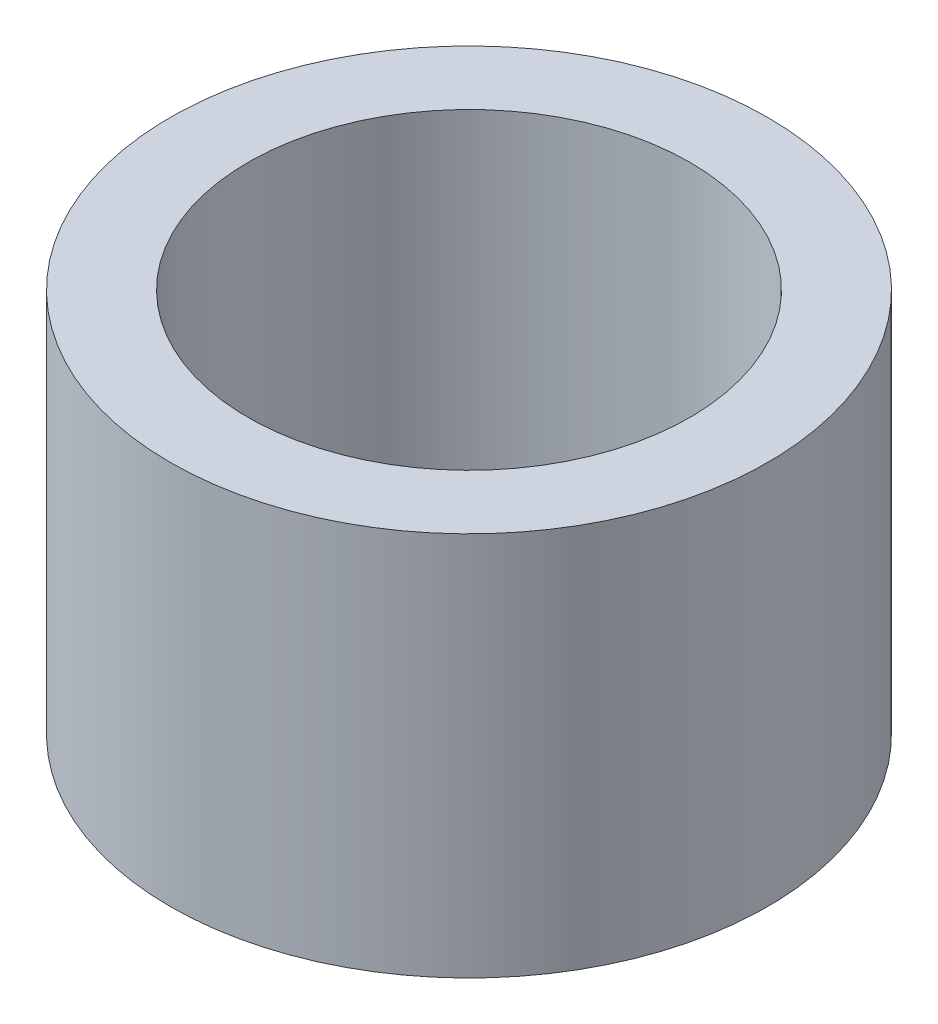
ISO-10303-21;
HEADER;
FILE_DESCRIPTION(('STEP AP214'),'2;1');
FILE_NAME('part.step','',(''),(''),'','','');
FILE_SCHEMA(('AUTOMOTIVE_DESIGN { 1 0 10303 214 1 1 1 1 }'));
ENDSEC;
DATA;
#1=APPLICATION_CONTEXT('core data for automotive mechanical design processes');
#2=APPLICATION_PROTOCOL_DEFINITION('international standard','automotive_design',2000,#1);
#3=PRODUCT_CONTEXT('',#1,'mechanical');
#4=PRODUCT('Part','Part','',(#3));
#5=PRODUCT_RELATED_PRODUCT_CATEGORY('part','',(#4));
#6=PRODUCT_DEFINITION_FORMATION('','',#4);
#7=PRODUCT_DEFINITION_CONTEXT('part definition',#1,'design');
#8=PRODUCT_DEFINITION('design','',#6,#7);
#9=PRODUCT_DEFINITION_SHAPE('','',#8);
#10=(LENGTH_UNIT() NAMED_UNIT(*) SI_UNIT(.MILLI.,.METRE.));
#11=(NAMED_UNIT(*) PLANE_ANGLE_UNIT() SI_UNIT($,.RADIAN.));
#12=(NAMED_UNIT(*) SI_UNIT($,.STERADIAN.) SOLID_ANGLE_UNIT());
#13=UNCERTAINTY_MEASURE_WITH_UNIT(LENGTH_MEASURE(1.E-05),#10,'distance_accuracy_value','');
#14=(GEOMETRIC_REPRESENTATION_CONTEXT(3) GLOBAL_UNCERTAINTY_ASSIGNED_CONTEXT((#13)) GLOBAL_UNIT_ASSIGNED_CONTEXT((#10,
#11,#12)) REPRESENTATION_CONTEXT('',''));
#15=CARTESIAN_POINT('',(0.,0.,0.));
#16=DIRECTION('',(0.,0.,1.));
#17=DIRECTION('',(1.,0.,0.));
#18=AXIS2_PLACEMENT_3D('',#15,#16,#17);
#19=CARTESIAN_POINT('',(0.,28.9701515864055,0.));
#20=DIRECTION('',(0.,-1.,0.));
#21=DIRECTION('',(0.,0.,-1.));
#22=AXIS2_PLACEMENT_3D('',#19,#20,#21);
#23=CYLINDRICAL_SURFACE('',#22,22.5);
#24=CARTESIAN_POINT('',(0.,28.9701515864055,0.));
#25=DIRECTION('',(0.,1.,0.));
#26=DIRECTION('',(0.,0.,1.));
#27=AXIS2_PLACEMENT_3D('',#24,#25,#26);
#28=CIRCLE('',#27,22.5);
#29=CARTESIAN_POINT('',(0.,28.9701515864055,-22.5));
#30=VERTEX_POINT('',#29);
#31=EDGE_CURVE('E10',#30,#30,#28,.T.);
#32=CARTESIAN_POINT('',(0.,0.,0.));
#33=DIRECTION('',(0.,1.,0.));
#34=DIRECTION('',(0.,0.,1.));
#35=AXIS2_PLACEMENT_3D('',#32,#33,#34);
#36=CIRCLE('',#35,22.5);
#37=CARTESIAN_POINT('',(0.,0.,-22.5));
#38=VERTEX_POINT('',#37);
#39=EDGE_CURVE('E37',#38,#38,#36,.T.);
#40=CARTESIAN_POINT('',(0.,28.9701515864055,-22.5));
#41=CARTESIAN_POINT('',(0.,28.6683791740471,-22.5));
#42=CARTESIAN_POINT('',(0.,28.3666067616887,-22.5));
#43=CARTESIAN_POINT('',(0.,27.763061936972,-22.5));
#44=CARTESIAN_POINT('',(0.,27.4612895246136,-22.5));
#45=CARTESIAN_POINT('',(0.,26.8577446998968,-22.5));
#46=CARTESIAN_POINT('',(0.,26.5559722875384,-22.5));
#47=CARTESIAN_POINT('',(0.,25.9524274628216,-22.5));
#48=CARTESIAN_POINT('',(0.,25.6506550504632,-22.5));
#49=CARTESIAN_POINT('',(0.,25.0471102257464,-22.5));
#50=CARTESIAN_POINT('',(0.,24.745337813388,-22.5));
#51=CARTESIAN_POINT('',(0.,24.1417929886713,-22.5));
#52=CARTESIAN_POINT('',(0.,23.8400205763129,-22.5));
#53=CARTESIAN_POINT('',(0.,23.2364757515961,-22.5));
#54=CARTESIAN_POINT('',(0.,22.9347033392377,-22.5));
#55=CARTESIAN_POINT('',(0.,22.3311585145209,-22.5));
#56=CARTESIAN_POINT('',(0.,22.0293861021625,-22.5));
#57=CARTESIAN_POINT('',(0.,21.4258412774457,-22.5));
#58=CARTESIAN_POINT('',(0.,21.1240688650874,-22.5));
#59=CARTESIAN_POINT('',(0.,20.5205240403706,-22.5));
#60=CARTESIAN_POINT('',(0.,20.2187516280122,-22.5));
#61=CARTESIAN_POINT('',(0.,19.6152068032954,-22.5));
#62=CARTESIAN_POINT('',(0.,19.313434390937,-22.5));
#63=CARTESIAN_POINT('',(0.,18.7098895662202,-22.5));
#64=CARTESIAN_POINT('',(0.,18.4081171538618,-22.5));
#65=CARTESIAN_POINT('',(0.,17.8045723291451,-22.5));
#66=CARTESIAN_POINT('',(0.,17.5027999167867,-22.5));
#67=CARTESIAN_POINT('',(0.,16.8992550920699,-22.5));
#68=CARTESIAN_POINT('',(0.,16.5974826797115,-22.5));
#69=CARTESIAN_POINT('',(0.,15.9939378549947,-22.5));
#70=CARTESIAN_POINT('',(0.,15.6921654426363,-22.5));
#71=CARTESIAN_POINT('',(0.,15.0886206179195,-22.5));
#72=CARTESIAN_POINT('',(0.,14.7868482055611,-22.5));
#73=CARTESIAN_POINT('',(0.,14.1833033808444,-22.5));
#74=CARTESIAN_POINT('',(0.,13.881530968486,-22.5));
#75=CARTESIAN_POINT('',(0.,13.2779861437692,-22.5));
#76=CARTESIAN_POINT('',(0.,12.9762137314108,-22.5));
#77=CARTESIAN_POINT('',(0.,12.372668906694,-22.5));
#78=CARTESIAN_POINT('',(0.,12.0708964943356,-22.5));
#79=CARTESIAN_POINT('',(0.,11.4673516696188,-22.5));
#80=CARTESIAN_POINT('',(0.,11.1655792572605,-22.5));
#81=CARTESIAN_POINT('',(0.,10.5620344325437,-22.5));
#82=CARTESIAN_POINT('',(0.,10.2602620201853,-22.5));
#83=CARTESIAN_POINT('',(0.,9.65671719546851,-22.5));
#84=CARTESIAN_POINT('',(0.,9.35494478311011,-22.5));
#85=CARTESIAN_POINT('',(0.,8.75139995839333,-22.5));
#86=CARTESIAN_POINT('',(0.,8.44962754603494,-22.5));
#87=CARTESIAN_POINT('',(0.,7.84608272131816,-22.5));
#88=CARTESIAN_POINT('',(0.,7.54431030895977,-22.5));
#89=CARTESIAN_POINT('',(0.,6.94076548424299,-22.5));
#90=CARTESIAN_POINT('',(0.,6.6389930718846,-22.5));
#91=CARTESIAN_POINT('',(0.,6.03544824716782,-22.5));
#92=CARTESIAN_POINT('',(0.,5.73367583480942,-22.5));
#93=CARTESIAN_POINT('',(0.,5.13013101009264,-22.5));
#94=CARTESIAN_POINT('',(0.,4.82835859773425,-22.5));
#95=CARTESIAN_POINT('',(0.,4.22481377301747,-22.5));
#96=CARTESIAN_POINT('',(0.,3.92304136065908,-22.5));
#97=CARTESIAN_POINT('',(0.,3.3194965359423,-22.5));
#98=CARTESIAN_POINT('',(0.,3.01772412358391,-22.5));
#99=CARTESIAN_POINT('',(0.,2.41417929886713,-22.5));
#100=CARTESIAN_POINT('',(0.,2.11240688650874,-22.5));
#101=CARTESIAN_POINT('',(0.,1.50886206179195,-22.5));
#102=CARTESIAN_POINT('',(0.,1.20708964943356,-22.5));
#103=CARTESIAN_POINT('',(0.,0.603544824716781,-22.5));
#104=CARTESIAN_POINT('',(0.,0.30177241235839,-22.5));
#105=CARTESIAN_POINT('',(0.,0.,-22.5));
#106=B_SPLINE_CURVE_WITH_KNOTS('',3,(#40,#41,#42,#43,#44,#45,#46,#47,#48,#49,#50,#51,#52,#53,
#54,#55,#56,#57,#58,#59,#60,#61,#62,#63,#64,#65,#66,#67,#68,#69,#70,#71,#72,#73,#74,#75,#76,#77,
#78,#79,#80,#81,#82,#83,#84,#85,#86,#87,#88,#89,#90,#91,#92,#93,#94,#95,#96,#97,#98,#99,#100,
#101,#102,#103,#104,#105),.UNSPECIFIED.,.F.,.F.,(4,2,2,2,2,2,2,2,2,2,2,2,2,2,2,2,2,2,2,2,2,2,2,
2,2,2,2,2,2,2,2,2,4),(0.,0.905317237075171,1.81063447415034,2.71595171122551,3.62126894830069,
4.52658618537586,5.43190342245103,6.33722065952621,7.24253789660138,8.14785513367655,
9.05317237075172,9.95848960782689,10.8638068449021,11.7691240819772,12.6744413190524,
13.5797585561276,14.4850757932028,15.3903930302779,16.2957102673531,17.2010275044283,
18.1063447415034,19.0116619785786,19.9169792156538,20.822296452729,21.7276136898041,
22.6329309268793,23.5382481639545,24.4435654010297,25.3488826381048,26.25419987518,
27.1595171122552,28.0648343493303,28.9701515864055),.UNSPECIFIED.);
#107=EDGE_CURVE('BSEAM40',#30,#38,#106,.T.);
#108=ORIENTED_EDGE('',*,*,#31,.F.);
#109=ORIENTED_EDGE('',*,*,#39,.T.);
#110=ORIENTED_EDGE('',*,*,#107,.T.);
#111=ORIENTED_EDGE('',*,*,#107,.F.);
#112=EDGE_LOOP('',(#108,#110,#109,#111));
#113=FACE_BOUND('',#112,.T.);
#114=ADVANCED_FACE('F40',(#113),#23,.T.);
#115=CARTESIAN_POINT('',(0.,28.9701515864055,0.));
#116=DIRECTION('',(0.,1.,0.));
#117=DIRECTION('',(0.,0.,1.));
#118=AXIS2_PLACEMENT_3D('',#115,#116,#117);
#119=PLANE('',#118);
#120=CARTESIAN_POINT('',(0.,28.9701515864055,0.));
#121=DIRECTION('',(0.,1.,0.));
#122=DIRECTION('',(0.,0.,1.));
#123=AXIS2_PLACEMENT_3D('',#120,#121,#122);
#124=CIRCLE('',#123,16.6405609110903);
#125=CARTESIAN_POINT('',(0.,28.9701515864055,-16.6405609110903));
#126=VERTEX_POINT('',#125);
#127=EDGE_CURVE('E50',#126,#126,#124,.T.);
#128=ORIENTED_EDGE('',*,*,#127,.F.);
#129=EDGE_LOOP('',(#128));
#130=FACE_BOUND('',#129,.T.);
#131=ORIENTED_EDGE('',*,*,#31,.T.);
#132=EDGE_LOOP('',(#131));
#133=FACE_BOUND('',#132,.T.);
#134=ADVANCED_FACE('F59',(#130,#133),#119,.T.);
#135=CARTESIAN_POINT('',(0.,0.,0.));
#136=DIRECTION('',(0.,1.,0.));
#137=DIRECTION('',(0.,0.,1.));
#138=AXIS2_PLACEMENT_3D('',#135,#136,#137);
#139=PLANE('',#138);
#140=CARTESIAN_POINT('',(0.,0.,0.));
#141=DIRECTION('',(0.,1.,0.));
#142=DIRECTION('',(0.,0.,1.));
#143=AXIS2_PLACEMENT_3D('',#140,#141,#142);
#144=CIRCLE('',#143,16.6405609110903);
#145=CARTESIAN_POINT('',(0.,0.,-16.6405609110903));
#146=VERTEX_POINT('',#145);
#147=EDGE_CURVE('E47',#146,#146,#144,.T.);
#148=ORIENTED_EDGE('',*,*,#147,.T.);
#149=EDGE_LOOP('',(#148));
#150=FACE_BOUND('',#149,.T.);
#151=ORIENTED_EDGE('',*,*,#39,.F.);
#152=EDGE_LOOP('',(#151));
#153=FACE_BOUND('',#152,.T.);
#154=ADVANCED_FACE('F58',(#150,#153),#139,.F.);
#155=CARTESIAN_POINT('',(0.,28.9701515864055,0.));
#156=DIRECTION('',(0.,-1.,0.));
#157=DIRECTION('',(0.,0.,-1.));
#158=AXIS2_PLACEMENT_3D('',#155,#156,#157);
#159=CYLINDRICAL_SURFACE('',#158,16.6405609110903);
#160=CARTESIAN_POINT('',(0.,28.9701515864055,-16.6405609110903));
#161=CARTESIAN_POINT('',(0.,28.6683791740471,-16.6405609110903));
#162=CARTESIAN_POINT('',(0.,28.3666067616887,-16.6405609110903));
#163=CARTESIAN_POINT('',(0.,27.763061936972,-16.6405609110903));
#164=CARTESIAN_POINT('',(0.,27.4612895246136,-16.6405609110903));
#165=CARTESIAN_POINT('',(0.,26.8577446998968,-16.6405609110903));
#166=CARTESIAN_POINT('',(0.,26.5559722875384,-16.6405609110903));
#167=CARTESIAN_POINT('',(0.,25.9524274628216,-16.6405609110903));
#168=CARTESIAN_POINT('',(0.,25.6506550504632,-16.6405609110903));
#169=CARTESIAN_POINT('',(0.,25.0471102257464,-16.6405609110903));
#170=CARTESIAN_POINT('',(0.,24.745337813388,-16.6405609110903));
#171=CARTESIAN_POINT('',(0.,24.1417929886713,-16.6405609110903));
#172=CARTESIAN_POINT('',(0.,23.8400205763129,-16.6405609110903));
#173=CARTESIAN_POINT('',(0.,23.2364757515961,-16.6405609110903));
#174=CARTESIAN_POINT('',(0.,22.9347033392377,-16.6405609110903));
#175=CARTESIAN_POINT('',(0.,22.3311585145209,-16.6405609110903));
#176=CARTESIAN_POINT('',(0.,22.0293861021625,-16.6405609110903));
#177=CARTESIAN_POINT('',(0.,21.4258412774457,-16.6405609110903));
#178=CARTESIAN_POINT('',(0.,21.1240688650874,-16.6405609110903));
#179=CARTESIAN_POINT('',(0.,20.5205240403706,-16.6405609110903));
#180=CARTESIAN_POINT('',(0.,20.2187516280122,-16.6405609110903));
#181=CARTESIAN_POINT('',(0.,19.6152068032954,-16.6405609110903));
#182=CARTESIAN_POINT('',(0.,19.313434390937,-16.6405609110903));
#183=CARTESIAN_POINT('',(0.,18.7098895662202,-16.6405609110903));
#184=CARTESIAN_POINT('',(0.,18.4081171538618,-16.6405609110903));
#185=CARTESIAN_POINT('',(0.,17.8045723291451,-16.6405609110903));
#186=CARTESIAN_POINT('',(0.,17.5027999167867,-16.6405609110903));
#187=CARTESIAN_POINT('',(0.,16.8992550920699,-16.6405609110903));
#188=CARTESIAN_POINT('',(0.,16.5974826797115,-16.6405609110903));
#189=CARTESIAN_POINT('',(0.,15.9939378549947,-16.6405609110903));
#190=CARTESIAN_POINT('',(0.,15.6921654426363,-16.6405609110903));
#191=CARTESIAN_POINT('',(0.,15.0886206179195,-16.6405609110903));
#192=CARTESIAN_POINT('',(0.,14.7868482055611,-16.6405609110903));
#193=CARTESIAN_POINT('',(0.,14.1833033808444,-16.6405609110903));
#194=CARTESIAN_POINT('',(0.,13.881530968486,-16.6405609110903));
#195=CARTESIAN_POINT('',(0.,13.2779861437692,-16.6405609110903));
#196=CARTESIAN_POINT('',(0.,12.9762137314108,-16.6405609110903));
#197=CARTESIAN_POINT('',(0.,12.372668906694,-16.6405609110903));
#198=CARTESIAN_POINT('',(0.,12.0708964943356,-16.6405609110903));
#199=CARTESIAN_POINT('',(0.,11.4673516696188,-16.6405609110903));
#200=CARTESIAN_POINT('',(0.,11.1655792572605,-16.6405609110903));
#201=CARTESIAN_POINT('',(0.,10.5620344325437,-16.6405609110903));
#202=CARTESIAN_POINT('',(0.,10.2602620201853,-16.6405609110903));
#203=CARTESIAN_POINT('',(0.,9.65671719546851,-16.6405609110903));
#204=CARTESIAN_POINT('',(0.,9.35494478311011,-16.6405609110903));
#205=CARTESIAN_POINT('',(0.,8.75139995839333,-16.6405609110903));
#206=CARTESIAN_POINT('',(0.,8.44962754603494,-16.6405609110903));
#207=CARTESIAN_POINT('',(0.,7.84608272131816,-16.6405609110903));
#208=CARTESIAN_POINT('',(0.,7.54431030895977,-16.6405609110903));
#209=CARTESIAN_POINT('',(0.,6.94076548424299,-16.6405609110903));
#210=CARTESIAN_POINT('',(0.,6.6389930718846,-16.6405609110903));
#211=CARTESIAN_POINT('',(0.,6.03544824716782,-16.6405609110903));
#212=CARTESIAN_POINT('',(0.,5.73367583480942,-16.6405609110903));
#213=CARTESIAN_POINT('',(0.,5.13013101009264,-16.6405609110903));
#214=CARTESIAN_POINT('',(0.,4.82835859773425,-16.6405609110903));
#215=CARTESIAN_POINT('',(0.,4.22481377301747,-16.6405609110903));
#216=CARTESIAN_POINT('',(0.,3.92304136065908,-16.6405609110903));
#217=CARTESIAN_POINT('',(0.,3.3194965359423,-16.6405609110903));
#218=CARTESIAN_POINT('',(0.,3.01772412358391,-16.6405609110903));
#219=CARTESIAN_POINT('',(0.,2.41417929886713,-16.6405609110903));
#220=CARTESIAN_POINT('',(0.,2.11240688650874,-16.6405609110903));
#221=CARTESIAN_POINT('',(0.,1.50886206179195,-16.6405609110903));
#222=CARTESIAN_POINT('',(0.,1.20708964943356,-16.6405609110903));
#223=CARTESIAN_POINT('',(0.,0.603544824716781,-16.6405609110903));
#224=CARTESIAN_POINT('',(0.,0.30177241235839,-16.6405609110903));
#225=CARTESIAN_POINT('',(0.,0.,-16.6405609110903));
#226=B_SPLINE_CURVE_WITH_KNOTS('',3,(#160,#161,#162,#163,#164,#165,#166,#167,#168,#169,#170,
#171,#172,#173,#174,#175,#176,#177,#178,#179,#180,#181,#182,#183,#184,#185,#186,#187,#188,#189,
#190,#191,#192,#193,#194,#195,#196,#197,#198,#199,#200,#201,#202,#203,#204,#205,#206,#207,#208,
#209,#210,#211,#212,#213,#214,#215,#216,#217,#218,#219,#220,#221,#222,#223,#224,#225),
.UNSPECIFIED.,.F.,.F.,(4,2,2,2,2,2,2,2,2,2,2,2,2,2,2,2,2,2,2,2,2,2,2,2,2,2,2,2,2,2,2,2,4),(0.,
0.905317237075171,1.81063447415034,2.71595171122551,3.62126894830069,4.52658618537586,
5.43190342245103,6.33722065952621,7.24253789660138,8.14785513367655,9.05317237075172,
9.95848960782689,10.8638068449021,11.7691240819772,12.6744413190524,13.5797585561276,
14.4850757932028,15.3903930302779,16.2957102673531,17.2010275044283,18.1063447415034,
19.0116619785786,19.9169792156538,20.822296452729,21.7276136898041,22.6329309268793,
23.5382481639545,24.4435654010297,25.3488826381048,26.25419987518,27.1595171122552,
28.0648343493303,28.9701515864055),.UNSPECIFIED.);
#227=EDGE_CURVE('BSEAM54',#126,#146,#226,.T.);
#228=ORIENTED_EDGE('',*,*,#127,.T.);
#229=ORIENTED_EDGE('',*,*,#147,.F.);
#230=ORIENTED_EDGE('',*,*,#227,.T.);
#231=ORIENTED_EDGE('',*,*,#227,.F.);
#232=EDGE_LOOP('',(#228,#230,#229,#231));
#233=FACE_BOUND('',#232,.T.);
#234=ADVANCED_FACE('F54',(#233),#159,.F.);
#235=CLOSED_SHELL('',(#114,#134,#154,#234));
#236=MANIFOLD_SOLID_BREP('B2',#235);
#237=ADVANCED_BREP_SHAPE_REPRESENTATION('',(#18,#236),#14);
#238=SHAPE_DEFINITION_REPRESENTATION(#9,#237);
ENDSEC;
END-ISO-10303-21;
